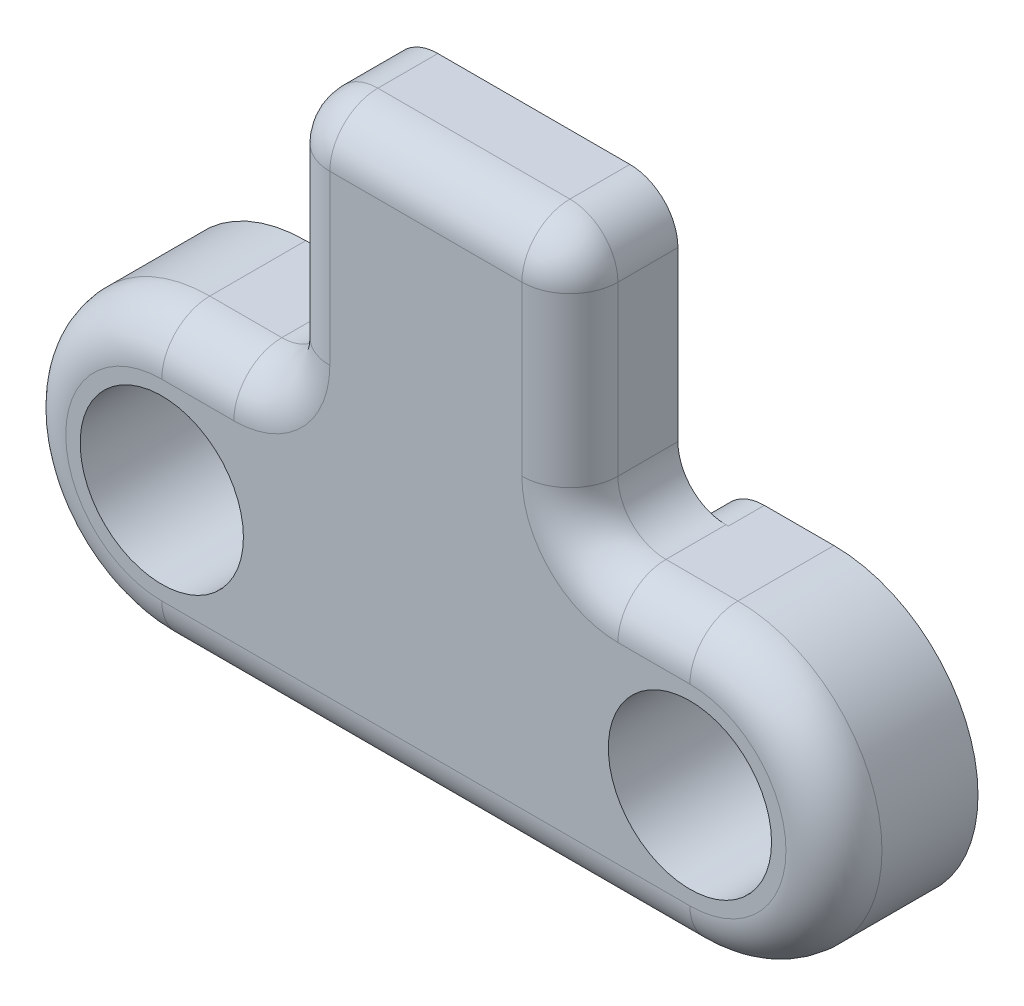
ISO-10303-21;
HEADER;
FILE_DESCRIPTION(('STEP AP214'),'2;1');
FILE_NAME('part.step','',(''),(''),'','','');
FILE_SCHEMA(('AUTOMOTIVE_DESIGN { 1 0 10303 214 1 1 1 1 }'));
ENDSEC;
DATA;
#1=APPLICATION_CONTEXT('core data for automotive mechanical design processes');
#2=APPLICATION_PROTOCOL_DEFINITION('international standard','automotive_design',2000,#1);
#3=PRODUCT_CONTEXT('',#1,'mechanical');
#4=PRODUCT('Part','Part','',(#3));
#5=PRODUCT_RELATED_PRODUCT_CATEGORY('part','',(#4));
#6=PRODUCT_DEFINITION_FORMATION('','',#4);
#7=PRODUCT_DEFINITION_CONTEXT('part definition',#1,'design');
#8=PRODUCT_DEFINITION('design','',#6,#7);
#9=PRODUCT_DEFINITION_SHAPE('','',#8);
#10=(LENGTH_UNIT() NAMED_UNIT(*) SI_UNIT(.MILLI.,.METRE.));
#11=(NAMED_UNIT(*) PLANE_ANGLE_UNIT() SI_UNIT($,.RADIAN.));
#12=(NAMED_UNIT(*) SI_UNIT($,.STERADIAN.) SOLID_ANGLE_UNIT());
#13=UNCERTAINTY_MEASURE_WITH_UNIT(LENGTH_MEASURE(1.E-05),#10,'distance_accuracy_value','');
#14=(GEOMETRIC_REPRESENTATION_CONTEXT(3) GLOBAL_UNCERTAINTY_ASSIGNED_CONTEXT((#13)) GLOBAL_UNIT_ASSIGNED_CONTEXT((#10,
#11,#12)) REPRESENTATION_CONTEXT('',''));
#15=CARTESIAN_POINT('',(0.,0.,0.));
#16=DIRECTION('',(0.,0.,1.));
#17=DIRECTION('',(1.,0.,0.));
#18=AXIS2_PLACEMENT_3D('',#15,#16,#17);
#19=CARTESIAN_POINT('',(0.,0.,0.));
#20=DIRECTION('',(0.,0.,1.));
#21=DIRECTION('',(1.,0.,0.));
#22=AXIS2_PLACEMENT_3D('',#19,#20,#21);
#23=PLANE('',#22);
#24=CARTESIAN_POINT('',(-5.5,0.,0.));
#25=DIRECTION('',(0.,0.,1.));
#26=DIRECTION('',(1.,0.,0.));
#27=AXIS2_PLACEMENT_3D('',#24,#25,#26);
#28=CIRCLE('',#27,1.7);
#29=CARTESIAN_POINT('',(-3.8,0.,0.));
#30=VERTEX_POINT('',#29);
#31=EDGE_CURVE('E314',#30,#30,#28,.T.);
#32=ORIENTED_EDGE('',*,*,#31,.T.);
#33=EDGE_LOOP('',(#32));
#34=FACE_BOUND('',#33,.T.);
#35=DIRECTION('',(0.,1.,0.));
#36=VECTOR('',#35,1.);
#37=CARTESIAN_POINT('',(-3.05,-3.,0.));
#38=LINE('',#37,#36);
#39=CARTESIAN_POINT('',(-3.05,-2.,0.));
#40=VERTEX_POINT('',#39);
#41=CARTESIAN_POINT('',(-3.05,2.,0.));
#42=VERTEX_POINT('',#41);
#43=EDGE_CURVE('E570',#40,#42,#38,.T.);
#44=ORIENTED_EDGE('',*,*,#43,.F.);
#45=CARTESIAN_POINT('',(-4.05,-2.,0.));
#46=DIRECTION('',(0.,0.,1.));
#47=DIRECTION('',(1.,0.,0.));
#48=AXIS2_PLACEMENT_3D('',#45,#46,#47);
#49=CIRCLE('',#48,1.);
#50=CARTESIAN_POINT('',(-4.05,-3.,0.));
#51=VERTEX_POINT('',#50);
#52=EDGE_CURVE('E490',#40,#51,#49,.F.);
#53=ORIENTED_EDGE('',*,*,#52,.T.);
#54=DIRECTION('',(1.,0.,0.));
#55=VECTOR('',#54,1.);
#56=CARTESIAN_POINT('',(0.,-3.,0.));
#57=LINE('',#56,#55);
#58=CARTESIAN_POINT('',(-5.5,-3.,0.));
#59=VERTEX_POINT('',#58);
#60=EDGE_CURVE('E313',#59,#51,#57,.T.);
#61=ORIENTED_EDGE('',*,*,#60,.F.);
#62=CARTESIAN_POINT('',(-5.5,0.,0.));
#63=DIRECTION('',(0.,0.,1.));
#64=DIRECTION('',(1.,0.,0.));
#65=AXIS2_PLACEMENT_3D('',#62,#63,#64);
#66=CIRCLE('',#65,3.);
#67=CARTESIAN_POINT('',(-5.5,3.,0.));
#68=VERTEX_POINT('',#67);
#69=EDGE_CURVE('E333',#68,#59,#66,.T.);
#70=ORIENTED_EDGE('',*,*,#69,.F.);
#71=DIRECTION('',(1.,0.,0.));
#72=VECTOR('',#71,1.);
#73=CARTESIAN_POINT('',(0.,3.,0.));
#74=LINE('',#73,#72);
#75=CARTESIAN_POINT('',(-4.05,3.,0.));
#76=VERTEX_POINT('',#75);
#77=EDGE_CURVE('E325',#68,#76,#74,.T.);
#78=ORIENTED_EDGE('',*,*,#77,.T.);
#79=CARTESIAN_POINT('',(-4.05,2.,0.));
#80=DIRECTION('',(0.,0.,1.));
#81=DIRECTION('',(1.,0.,0.));
#82=AXIS2_PLACEMENT_3D('',#79,#80,#81);
#83=CIRCLE('',#82,1.);
#84=EDGE_CURVE('E487',#76,#42,#83,.F.);
#85=ORIENTED_EDGE('',*,*,#84,.T.);
#86=EDGE_LOOP('',(#44,#53,#61,#70,#78,#85));
#87=FACE_BOUND('',#86,.T.);
#88=ADVANCED_FACE('F72',(#34,#87),#23,.F.);
#89=CARTESIAN_POINT('',(5.5,0.,3.));
#90=DIRECTION('',(0.,0.,-1.));
#91=DIRECTION('',(-1.,0.,0.));
#92=AXIS2_PLACEMENT_3D('',#89,#90,#91);
#93=CYLINDRICAL_SURFACE('',#92,3.);
#94=DIRECTION('',(0.,0.,-1.));
#95=VECTOR('',#94,1.);
#96=CARTESIAN_POINT('',(5.5,3.,3.));
#97=LINE('',#96,#95);
#98=CARTESIAN_POINT('',(5.5,3.,2.));
#99=VERTEX_POINT('',#98);
#100=CARTESIAN_POINT('',(5.5,3.,0.));
#101=VERTEX_POINT('',#100);
#102=EDGE_CURVE('E303',#99,#101,#97,.T.);
#103=ORIENTED_EDGE('',*,*,#102,.F.);
#104=CARTESIAN_POINT('',(5.5,0.,2.));
#105=DIRECTION('',(0.,0.,1.));
#106=DIRECTION('',(1.,0.,0.));
#107=AXIS2_PLACEMENT_3D('',#104,#105,#106);
#108=CIRCLE('',#107,3.);
#109=CARTESIAN_POINT('',(5.5,-3.,2.));
#110=VERTEX_POINT('',#109);
#111=EDGE_CURVE('E298',#99,#110,#108,.F.);
#112=ORIENTED_EDGE('',*,*,#111,.T.);
#113=DIRECTION('',(0.,0.,-1.));
#114=VECTOR('',#113,1.);
#115=CARTESIAN_POINT('',(5.5,-3.,3.));
#116=LINE('',#115,#114);
#117=CARTESIAN_POINT('',(5.5,-3.,0.));
#118=VERTEX_POINT('',#117);
#119=EDGE_CURVE('E291',#110,#118,#116,.T.);
#120=ORIENTED_EDGE('',*,*,#119,.T.);
#121=CARTESIAN_POINT('',(5.5,0.,0.));
#122=DIRECTION('',(0.,0.,1.));
#123=DIRECTION('',(1.,0.,0.));
#124=AXIS2_PLACEMENT_3D('',#121,#122,#123);
#125=CIRCLE('',#124,3.);
#126=EDGE_CURVE('E296',#118,#101,#125,.T.);
#127=ORIENTED_EDGE('',*,*,#126,.T.);
#128=EDGE_LOOP('',(#103,#112,#120,#127));
#129=FACE_BOUND('',#128,.T.);
#130=ADVANCED_FACE('F294',(#129),#93,.T.);
#131=CARTESIAN_POINT('',(0.,3.,3.));
#132=DIRECTION('',(0.,1.,0.));
#133=DIRECTION('',(0.,0.,1.));
#134=AXIS2_PLACEMENT_3D('',#131,#132,#133);
#135=PLANE('',#134);
#136=DIRECTION('',(0.,0.,1.));
#137=VECTOR('',#136,1.);
#138=CARTESIAN_POINT('',(4.,3.,3.));
#139=LINE('',#138,#137);
#140=CARTESIAN_POINT('',(4.,3.,0.750000000000001));
#141=VERTEX_POINT('',#140);
#142=CARTESIAN_POINT('',(4.,3.,2.));
#143=VERTEX_POINT('',#142);
#144=EDGE_CURVE('E377',#141,#143,#139,.T.);
#145=ORIENTED_EDGE('',*,*,#144,.T.);
#146=DIRECTION('',(1.,0.,0.));
#147=VECTOR('',#146,1.);
#148=CARTESIAN_POINT('',(0.,3.,2.));
#149=LINE('',#148,#147);
#150=EDGE_CURVE('E444',#143,#99,#149,.T.);
#151=ORIENTED_EDGE('',*,*,#150,.T.);
#152=ORIENTED_EDGE('',*,*,#102,.T.);
#153=CARTESIAN_POINT('',(4.05,3.,0.));
#154=VERTEX_POINT('',#153);
#155=EDGE_CURVE('E318',#154,#101,#74,.T.);
#156=ORIENTED_EDGE('',*,*,#155,.F.);
#157=DIRECTION('',(0.,0.,-1.));
#158=VECTOR('',#157,1.);
#159=CARTESIAN_POINT('',(4.05,3.,0.750000000000001));
#160=LINE('',#159,#158);
#161=CARTESIAN_POINT('',(4.05,3.,0.750000000000001));
#162=VERTEX_POINT('',#161);
#163=EDGE_CURVE('E440',#154,#162,#160,.F.);
#164=ORIENTED_EDGE('',*,*,#163,.T.);
#165=DIRECTION('',(-1.,0.,0.));
#166=VECTOR('',#165,1.);
#167=CARTESIAN_POINT('',(-3.05,3.,0.750000000000001));
#168=LINE('',#167,#166);
#169=EDGE_CURVE('E436',#162,#141,#168,.T.);
#170=ORIENTED_EDGE('',*,*,#169,.T.);
#171=EDGE_LOOP('',(#145,#151,#152,#156,#164,#170));
#172=FACE_BOUND('',#171,.T.);
#173=ADVANCED_FACE('F620',(#172),#135,.T.);
#174=DIRECTION('',(0.,0.,-1.));
#175=VECTOR('',#174,1.);
#176=CARTESIAN_POINT('',(-5.5,3.,3.));
#177=LINE('',#176,#175);
#178=CARTESIAN_POINT('',(-5.5,3.,2.));
#179=VERTEX_POINT('',#178);
#180=EDGE_CURVE('E341',#179,#68,#177,.T.);
#181=ORIENTED_EDGE('',*,*,#180,.F.);
#182=DIRECTION('',(1.,0.,0.));
#183=VECTOR('',#182,1.);
#184=CARTESIAN_POINT('',(0.,3.,2.));
#185=LINE('',#184,#183);
#186=CARTESIAN_POINT('',(-4.,3.,2.));
#187=VERTEX_POINT('',#186);
#188=EDGE_CURVE('E499',#179,#187,#185,.T.);
#189=ORIENTED_EDGE('',*,*,#188,.T.);
#190=DIRECTION('',(0.,0.,1.));
#191=VECTOR('',#190,1.);
#192=CARTESIAN_POINT('',(-4.,3.,0.750000000000001));
#193=LINE('',#192,#191);
#194=CARTESIAN_POINT('',(-4.,3.,0.750000000000001));
#195=VERTEX_POINT('',#194);
#196=EDGE_CURVE('E381',#187,#195,#193,.F.);
#197=ORIENTED_EDGE('',*,*,#196,.T.);
#198=DIRECTION('',(-1.,0.,0.));
#199=VECTOR('',#198,1.);
#200=CARTESIAN_POINT('',(-3.05,3.,0.750000000000001));
#201=LINE('',#200,#199);
#202=CARTESIAN_POINT('',(-4.05,3.,0.750000000000001));
#203=VERTEX_POINT('',#202);
#204=EDGE_CURVE('E496',#195,#203,#201,.T.);
#205=ORIENTED_EDGE('',*,*,#204,.T.);
#206=DIRECTION('',(0.,0.,1.));
#207=VECTOR('',#206,1.);
#208=CARTESIAN_POINT('',(-4.05,3.,0.));
#209=LINE('',#208,#207);
#210=EDGE_CURVE('E493',#203,#76,#209,.F.);
#211=ORIENTED_EDGE('',*,*,#210,.T.);
#212=ORIENTED_EDGE('',*,*,#77,.F.);
#213=EDGE_LOOP('',(#181,#189,#197,#205,#211,#212));
#214=FACE_BOUND('',#213,.T.);
#215=ADVANCED_FACE('F750',(#214),#135,.T.);
#216=CARTESIAN_POINT('',(-5.5,0.,3.));
#217=DIRECTION('',(0.,0.,-1.));
#218=DIRECTION('',(-1.,0.,0.));
#219=AXIS2_PLACEMENT_3D('',#216,#217,#218);
#220=CYLINDRICAL_SURFACE('',#219,3.);
#221=DIRECTION('',(0.,0.,-1.));
#222=VECTOR('',#221,1.);
#223=CARTESIAN_POINT('',(-5.5,-3.,3.));
#224=LINE('',#223,#222);
#225=CARTESIAN_POINT('',(-5.5,-3.,2.));
#226=VERTEX_POINT('',#225);
#227=EDGE_CURVE('E338',#226,#59,#224,.T.);
#228=ORIENTED_EDGE('',*,*,#227,.F.);
#229=CARTESIAN_POINT('',(-5.5,0.,2.));
#230=DIRECTION('',(0.,0.,1.));
#231=DIRECTION('',(1.,0.,0.));
#232=AXIS2_PLACEMENT_3D('',#229,#230,#231);
#233=CIRCLE('',#232,3.);
#234=EDGE_CURVE('E421',#226,#179,#233,.F.);
#235=ORIENTED_EDGE('',*,*,#234,.T.);
#236=ORIENTED_EDGE('',*,*,#180,.T.);
#237=ORIENTED_EDGE('',*,*,#69,.T.);
#238=EDGE_LOOP('',(#228,#235,#236,#237));
#239=FACE_BOUND('',#238,.T.);
#240=ADVANCED_FACE('F613',(#239),#220,.T.);
#241=CARTESIAN_POINT('',(0.,-3.,3.));
#242=DIRECTION('',(0.,1.,0.));
#243=DIRECTION('',(0.,0.,1.));
#244=AXIS2_PLACEMENT_3D('',#241,#242,#243);
#245=PLANE('',#244);
#246=ORIENTED_EDGE('',*,*,#119,.F.);
#247=DIRECTION('',(1.,0.,0.));
#248=VECTOR('',#247,1.);
#249=CARTESIAN_POINT('',(-5.5,-3.,2.));
#250=LINE('',#249,#248);
#251=EDGE_CURVE('E431',#110,#226,#250,.F.);
#252=ORIENTED_EDGE('',*,*,#251,.T.);
#253=ORIENTED_EDGE('',*,*,#227,.T.);
#254=ORIENTED_EDGE('',*,*,#60,.T.);
#255=DIRECTION('',(0.,0.,1.));
#256=VECTOR('',#255,1.);
#257=CARTESIAN_POINT('',(-4.05,-3.,3.));
#258=LINE('',#257,#256);
#259=CARTESIAN_POINT('',(-4.05,-3.,0.750000000000001));
#260=VERTEX_POINT('',#259);
#261=EDGE_CURVE('E425',#51,#260,#258,.T.);
#262=ORIENTED_EDGE('',*,*,#261,.T.);
#263=DIRECTION('',(1.,0.,0.));
#264=VECTOR('',#263,1.);
#265=CARTESIAN_POINT('',(-3.05,-3.,0.750000000000001));
#266=LINE('',#265,#264);
#267=CARTESIAN_POINT('',(4.05,-3.,0.750000000000001));
#268=VERTEX_POINT('',#267);
#269=EDGE_CURVE('E558',#260,#268,#266,.T.);
#270=ORIENTED_EDGE('',*,*,#269,.T.);
#271=DIRECTION('',(0.,0.,-1.));
#272=VECTOR('',#271,1.);
#273=CARTESIAN_POINT('',(4.05,-3.,3.));
#274=LINE('',#273,#272);
#275=CARTESIAN_POINT('',(4.05,-3.,0.));
#276=VERTEX_POINT('',#275);
#277=EDGE_CURVE('E310',#268,#276,#274,.T.);
#278=ORIENTED_EDGE('',*,*,#277,.T.);
#279=EDGE_CURVE('E307',#276,#118,#57,.T.);
#280=ORIENTED_EDGE('',*,*,#279,.T.);
#281=EDGE_LOOP('',(#246,#252,#253,#254,#262,#270,#278,#280));
#282=FACE_BOUND('',#281,.T.);
#283=ADVANCED_FACE('F308',(#282),#245,.F.);
#284=CARTESIAN_POINT('',(-5.5,0.,3.));
#285=DIRECTION('',(0.,0.,-1.));
#286=DIRECTION('',(-1.,0.,0.));
#287=AXIS2_PLACEMENT_3D('',#284,#285,#286);
#288=CYLINDRICAL_SURFACE('',#287,1.7);
#289=CARTESIAN_POINT('',(-5.5,0.,3.));
#290=DIRECTION('',(0.,0.,1.));
#291=DIRECTION('',(1.,0.,0.));
#292=AXIS2_PLACEMENT_3D('',#289,#290,#291);
#293=CIRCLE('',#292,1.7);
#294=CARTESIAN_POINT('',(-3.8,0.,3.));
#295=VERTEX_POINT('',#294);
#296=EDGE_CURVE('E342',#295,#295,#293,.T.);
#297=ORIENTED_EDGE('',*,*,#296,.T.);
#298=EDGE_LOOP('',(#297));
#299=FACE_BOUND('',#298,.T.);
#300=ORIENTED_EDGE('',*,*,#31,.F.);
#301=EDGE_LOOP('',(#300));
#302=FACE_BOUND('',#301,.T.);
#303=ADVANCED_FACE('F602',(#299,#302),#288,.F.);
#304=CARTESIAN_POINT('',(5.5,0.,3.));
#305=DIRECTION('',(0.,0.,-1.));
#306=DIRECTION('',(-1.,0.,0.));
#307=AXIS2_PLACEMENT_3D('',#304,#305,#306);
#308=CYLINDRICAL_SURFACE('',#307,1.7);
#309=CARTESIAN_POINT('',(5.5,0.,3.));
#310=DIRECTION('',(0.,0.,1.));
#311=DIRECTION('',(1.,0.,0.));
#312=AXIS2_PLACEMENT_3D('',#309,#310,#311);
#313=CIRCLE('',#312,1.7);
#314=CARTESIAN_POINT('',(7.2,0.,3.));
#315=VERTEX_POINT('',#314);
#316=EDGE_CURVE('E337',#315,#315,#313,.T.);
#317=ORIENTED_EDGE('',*,*,#316,.T.);
#318=EDGE_LOOP('',(#317));
#319=FACE_BOUND('',#318,.T.);
#320=CARTESIAN_POINT('',(5.5,0.,0.));
#321=DIRECTION('',(0.,0.,1.));
#322=DIRECTION('',(1.,0.,0.));
#323=AXIS2_PLACEMENT_3D('',#320,#321,#322);
#324=CIRCLE('',#323,1.7);
#325=CARTESIAN_POINT('',(7.2,0.,0.));
#326=VERTEX_POINT('',#325);
#327=EDGE_CURVE('E588',#326,#326,#324,.T.);
#328=ORIENTED_EDGE('',*,*,#327,.F.);
#329=EDGE_LOOP('',(#328));
#330=FACE_BOUND('',#329,.T.);
#331=ADVANCED_FACE('F604',(#319,#330),#308,.F.);
#332=ORIENTED_EDGE('',*,*,#327,.T.);
#333=EDGE_LOOP('',(#332));
#334=FACE_BOUND('',#333,.T.);
#335=ORIENTED_EDGE('',*,*,#279,.F.);
#336=CARTESIAN_POINT('',(4.05,-2.,0.));
#337=DIRECTION('',(0.,0.,1.));
#338=DIRECTION('',(1.,0.,0.));
#339=AXIS2_PLACEMENT_3D('',#336,#337,#338);
#340=CIRCLE('',#339,1.);
#341=CARTESIAN_POINT('',(3.05,-2.,0.));
#342=VERTEX_POINT('',#341);
#343=EDGE_CURVE('E470',#276,#342,#340,.F.);
#344=ORIENTED_EDGE('',*,*,#343,.T.);
#345=DIRECTION('',(0.,1.,0.));
#346=VECTOR('',#345,1.);
#347=CARTESIAN_POINT('',(3.05,-3.,0.));
#348=LINE('',#347,#346);
#349=CARTESIAN_POINT('',(3.05,2.,0.));
#350=VERTEX_POINT('',#349);
#351=EDGE_CURVE('E575',#342,#350,#348,.T.);
#352=ORIENTED_EDGE('',*,*,#351,.T.);
#353=CARTESIAN_POINT('',(4.05,2.,0.));
#354=DIRECTION('',(0.,0.,1.));
#355=DIRECTION('',(1.,0.,0.));
#356=AXIS2_PLACEMENT_3D('',#353,#354,#355);
#357=CIRCLE('',#356,1.);
#358=EDGE_CURVE('E467',#350,#154,#357,.F.);
#359=ORIENTED_EDGE('',*,*,#358,.T.);
#360=ORIENTED_EDGE('',*,*,#155,.T.);
#361=ORIENTED_EDGE('',*,*,#126,.F.);
#362=EDGE_LOOP('',(#335,#344,#352,#359,#360,#361));
#363=FACE_BOUND('',#362,.T.);
#364=ADVANCED_FACE('F316',(#334,#363),#23,.F.);
#365=CARTESIAN_POINT('',(0.,0.,3.));
#366=DIRECTION('',(0.,0.,1.));
#367=DIRECTION('',(1.,0.,0.));
#368=AXIS2_PLACEMENT_3D('',#365,#366,#367);
#369=PLANE('',#368);
#370=DIRECTION('',(1.,0.,0.));
#371=VECTOR('',#370,1.);
#372=CARTESIAN_POINT('',(0.,2.,3.));
#373=LINE('',#372,#371);
#374=CARTESIAN_POINT('',(-4.,2.,3.));
#375=VERTEX_POINT('',#374);
#376=CARTESIAN_POINT('',(-5.5,2.,3.));
#377=VERTEX_POINT('',#376);
#378=EDGE_CURVE('E390',#375,#377,#373,.F.);
#379=ORIENTED_EDGE('',*,*,#378,.T.);
#380=CARTESIAN_POINT('',(-5.5,0.,3.));
#381=DIRECTION('',(0.,0.,1.));
#382=DIRECTION('',(1.,0.,0.));
#383=AXIS2_PLACEMENT_3D('',#380,#381,#382);
#384=CIRCLE('',#383,2.);
#385=CARTESIAN_POINT('',(-5.5,-2.,3.));
#386=VERTEX_POINT('',#385);
#387=EDGE_CURVE('E417',#377,#386,#384,.T.);
#388=ORIENTED_EDGE('',*,*,#387,.T.);
#389=DIRECTION('',(1.,0.,0.));
#390=VECTOR('',#389,1.);
#391=CARTESIAN_POINT('',(5.5,-2.,3.));
#392=LINE('',#391,#390);
#393=CARTESIAN_POINT('',(5.5,-2.,3.));
#394=VERTEX_POINT('',#393);
#395=EDGE_CURVE('E414',#386,#394,#392,.T.);
#396=ORIENTED_EDGE('',*,*,#395,.T.);
#397=CARTESIAN_POINT('',(5.5,0.,3.));
#398=DIRECTION('',(0.,0.,1.));
#399=DIRECTION('',(1.,0.,0.));
#400=AXIS2_PLACEMENT_3D('',#397,#398,#399);
#401=CIRCLE('',#400,2.);
#402=CARTESIAN_POINT('',(5.5,2.,3.));
#403=VERTEX_POINT('',#402);
#404=EDGE_CURVE('E411',#394,#403,#401,.T.);
#405=ORIENTED_EDGE('',*,*,#404,.T.);
#406=DIRECTION('',(1.,0.,0.));
#407=VECTOR('',#406,1.);
#408=CARTESIAN_POINT('',(0.,2.,3.));
#409=LINE('',#408,#407);
#410=CARTESIAN_POINT('',(4.,2.,3.));
#411=VERTEX_POINT('',#410);
#412=EDGE_CURVE('E408',#403,#411,#409,.F.);
#413=ORIENTED_EDGE('',*,*,#412,.T.);
#414=CARTESIAN_POINT('',(4.,4.,3.));
#415=DIRECTION('',(0.,0.,1.));
#416=DIRECTION('',(1.,0.,0.));
#417=AXIS2_PLACEMENT_3D('',#414,#415,#416);
#418=CIRCLE('',#417,2.);
#419=CARTESIAN_POINT('',(2.,4.,3.));
#420=VERTEX_POINT('',#419);
#421=EDGE_CURVE('E405',#411,#420,#418,.F.);
#422=ORIENTED_EDGE('',*,*,#421,.T.);
#423=DIRECTION('',(0.,1.,0.));
#424=VECTOR('',#423,1.);
#425=CARTESIAN_POINT('',(2.,7.5,3.));
#426=LINE('',#425,#424);
#427=CARTESIAN_POINT('',(2.,7.5,3.));
#428=VERTEX_POINT('',#427);
#429=EDGE_CURVE('E402',#420,#428,#426,.T.);
#430=ORIENTED_EDGE('',*,*,#429,.T.);
#431=DIRECTION('',(1.,0.,0.));
#432=VECTOR('',#431,1.);
#433=CARTESIAN_POINT('',(0.,7.5,3.));
#434=LINE('',#433,#432);
#435=CARTESIAN_POINT('',(-2.,7.5,3.));
#436=VERTEX_POINT('',#435);
#437=EDGE_CURVE('E399',#428,#436,#434,.F.);
#438=ORIENTED_EDGE('',*,*,#437,.T.);
#439=DIRECTION('',(0.,1.,0.));
#440=VECTOR('',#439,1.);
#441=CARTESIAN_POINT('',(-2.,0.,3.));
#442=LINE('',#441,#440);
#443=CARTESIAN_POINT('',(-2.,4.,3.));
#444=VERTEX_POINT('',#443);
#445=EDGE_CURVE('E396',#436,#444,#442,.F.);
#446=ORIENTED_EDGE('',*,*,#445,.T.);
#447=CARTESIAN_POINT('',(-4.,4.,3.));
#448=DIRECTION('',(0.,0.,1.));
#449=DIRECTION('',(1.,0.,0.));
#450=AXIS2_PLACEMENT_3D('',#447,#448,#449);
#451=CIRCLE('',#450,2.);
#452=EDGE_CURVE('E393',#444,#375,#451,.F.);
#453=ORIENTED_EDGE('',*,*,#452,.T.);
#454=EDGE_LOOP('',(#379,#388,#396,#405,#413,#422,#430,#438,#446,#453));
#455=FACE_BOUND('',#454,.T.);
#456=ORIENTED_EDGE('',*,*,#316,.F.);
#457=EDGE_LOOP('',(#456));
#458=FACE_BOUND('',#457,.T.);
#459=ORIENTED_EDGE('',*,*,#296,.F.);
#460=EDGE_LOOP('',(#459));
#461=FACE_BOUND('',#460,.T.);
#462=ADVANCED_FACE('F625',(#455,#458,#461),#369,.T.);
#463=CARTESIAN_POINT('',(-3.,3.,3.));
#464=DIRECTION('',(-1.,0.,0.));
#465=DIRECTION('',(0.,0.,1.));
#466=AXIS2_PLACEMENT_3D('',#463,#464,#465);
#467=PLANE('',#466);
#468=DIRECTION('',(0.,0.,1.));
#469=VECTOR('',#468,1.);
#470=CARTESIAN_POINT('',(-3.,4.,3.));
#471=LINE('',#470,#469);
#472=CARTESIAN_POINT('',(-3.,4.,0.750000000000001));
#473=VERTEX_POINT('',#472);
#474=CARTESIAN_POINT('',(-3.,4.,2.));
#475=VERTEX_POINT('',#474);
#476=EDGE_CURVE('E370',#473,#475,#471,.T.);
#477=ORIENTED_EDGE('',*,*,#476,.T.);
#478=DIRECTION('',(0.,1.,0.));
#479=VECTOR('',#478,1.);
#480=CARTESIAN_POINT('',(-3.,3.,2.));
#481=LINE('',#480,#479);
#482=CARTESIAN_POINT('',(-3.,7.5,2.));
#483=VERTEX_POINT('',#482);
#484=EDGE_CURVE('E461',#475,#483,#481,.T.);
#485=ORIENTED_EDGE('',*,*,#484,.T.);
#486=DIRECTION('',(0.,0.,-1.));
#487=VECTOR('',#486,1.);
#488=CARTESIAN_POINT('',(-3.,7.5,3.));
#489=LINE('',#488,#487);
#490=CARTESIAN_POINT('',(-3.,7.5,0.750000000000001));
#491=VERTEX_POINT('',#490);
#492=EDGE_CURVE('E374',#483,#491,#489,.T.);
#493=ORIENTED_EDGE('',*,*,#492,.T.);
#494=DIRECTION('',(0.,1.,0.));
#495=VECTOR('',#494,1.);
#496=CARTESIAN_POINT('',(-3.,3.,0.750000000000001));
#497=LINE('',#496,#495);
#498=EDGE_CURVE('E584',#473,#491,#497,.T.);
#499=ORIENTED_EDGE('',*,*,#498,.F.);
#500=EDGE_LOOP('',(#477,#485,#493,#499));
#501=FACE_BOUND('',#500,.T.);
#502=ADVANCED_FACE('F630',(#501),#467,.T.);
#503=CARTESIAN_POINT('',(3.,3.,3.));
#504=DIRECTION('',(-1.,0.,0.));
#505=DIRECTION('',(0.,0.,1.));
#506=AXIS2_PLACEMENT_3D('',#503,#504,#505);
#507=PLANE('',#506);
#508=DIRECTION('',(0.,0.,-1.));
#509=VECTOR('',#508,1.);
#510=CARTESIAN_POINT('',(3.,7.5,3.));
#511=LINE('',#510,#509);
#512=CARTESIAN_POINT('',(3.,7.5,0.750000000000001));
#513=VERTEX_POINT('',#512);
#514=CARTESIAN_POINT('',(3.,7.5,2.));
#515=VERTEX_POINT('',#514);
#516=EDGE_CURVE('E366',#513,#515,#511,.F.);
#517=ORIENTED_EDGE('',*,*,#516,.T.);
#518=DIRECTION('',(0.,1.,0.));
#519=VECTOR('',#518,1.);
#520=CARTESIAN_POINT('',(3.,4.,2.));
#521=LINE('',#520,#519);
#522=CARTESIAN_POINT('',(3.,4.,2.));
#523=VERTEX_POINT('',#522);
#524=EDGE_CURVE('E450',#515,#523,#521,.F.);
#525=ORIENTED_EDGE('',*,*,#524,.T.);
#526=DIRECTION('',(0.,0.,1.));
#527=VECTOR('',#526,1.);
#528=CARTESIAN_POINT('',(3.,4.,3.));
#529=LINE('',#528,#527);
#530=CARTESIAN_POINT('',(3.,4.,0.750000000000001));
#531=VERTEX_POINT('',#530);
#532=EDGE_CURVE('E363',#523,#531,#529,.F.);
#533=ORIENTED_EDGE('',*,*,#532,.T.);
#534=DIRECTION('',(0.,1.,0.));
#535=VECTOR('',#534,1.);
#536=CARTESIAN_POINT('',(3.,3.,0.750000000000001));
#537=LINE('',#536,#535);
#538=EDGE_CURVE('E574',#531,#513,#537,.T.);
#539=ORIENTED_EDGE('',*,*,#538,.T.);
#540=EDGE_LOOP('',(#517,#525,#533,#539));
#541=FACE_BOUND('',#540,.T.);
#542=ADVANCED_FACE('F638',(#541),#507,.F.);
#543=CARTESIAN_POINT('',(-3.,8.5,3.));
#544=DIRECTION('',(0.,1.,0.));
#545=DIRECTION('',(0.,0.,1.));
#546=AXIS2_PLACEMENT_3D('',#543,#544,#545);
#547=PLANE('',#546);
#548=DIRECTION('',(0.,0.,-1.));
#549=VECTOR('',#548,1.);
#550=CARTESIAN_POINT('',(-2.,8.5,3.));
#551=LINE('',#550,#549);
#552=CARTESIAN_POINT('',(-2.,8.5,0.750000000000001));
#553=VERTEX_POINT('',#552);
#554=CARTESIAN_POINT('',(-2.,8.5,2.));
#555=VERTEX_POINT('',#554);
#556=EDGE_CURVE('E350',#553,#555,#551,.F.);
#557=ORIENTED_EDGE('',*,*,#556,.T.);
#558=DIRECTION('',(1.,0.,0.));
#559=VECTOR('',#558,1.);
#560=CARTESIAN_POINT('',(-3.,8.5,2.));
#561=LINE('',#560,#559);
#562=CARTESIAN_POINT('',(2.,8.5,2.));
#563=VERTEX_POINT('',#562);
#564=EDGE_CURVE('E455',#555,#563,#561,.T.);
#565=ORIENTED_EDGE('',*,*,#564,.T.);
#566=DIRECTION('',(0.,0.,-1.));
#567=VECTOR('',#566,1.);
#568=CARTESIAN_POINT('',(2.,8.5,0.750000000000001));
#569=LINE('',#568,#567);
#570=CARTESIAN_POINT('',(2.,8.5,0.750000000000001));
#571=VERTEX_POINT('',#570);
#572=EDGE_CURVE('E354',#563,#571,#569,.T.);
#573=ORIENTED_EDGE('',*,*,#572,.T.);
#574=DIRECTION('',(1.,0.,0.));
#575=VECTOR('',#574,1.);
#576=CARTESIAN_POINT('',(-3.,8.5,0.750000000000001));
#577=LINE('',#576,#575);
#578=EDGE_CURVE('E302',#553,#571,#577,.T.);
#579=ORIENTED_EDGE('',*,*,#578,.F.);
#580=EDGE_LOOP('',(#557,#565,#573,#579));
#581=FACE_BOUND('',#580,.T.);
#582=ADVANCED_FACE('F632',(#581),#547,.T.);
#583=CARTESIAN_POINT('',(-3.05,-3.,0.));
#584=DIRECTION('',(-1.,0.,0.));
#585=DIRECTION('',(0.,0.,1.));
#586=AXIS2_PLACEMENT_3D('',#583,#584,#585);
#587=PLANE('',#586);
#588=DIRECTION('',(0.,1.,0.));
#589=VECTOR('',#588,1.);
#590=CARTESIAN_POINT('',(-3.05,-3.,0.750000000000001));
#591=LINE('',#590,#589);
#592=CARTESIAN_POINT('',(-3.05,-2.,0.750000000000001));
#593=VERTEX_POINT('',#592);
#594=CARTESIAN_POINT('',(-3.05,2.,0.750000000000001));
#595=VERTEX_POINT('',#594);
#596=EDGE_CURVE('E564',#593,#595,#591,.T.);
#597=ORIENTED_EDGE('',*,*,#596,.F.);
#598=DIRECTION('',(0.,0.,1.));
#599=VECTOR('',#598,1.);
#600=CARTESIAN_POINT('',(-3.05,-2.,0.));
#601=LINE('',#600,#599);
#602=EDGE_CURVE('E484',#593,#40,#601,.F.);
#603=ORIENTED_EDGE('',*,*,#602,.T.);
#604=ORIENTED_EDGE('',*,*,#43,.T.);
#605=DIRECTION('',(0.,0.,1.));
#606=VECTOR('',#605,1.);
#607=CARTESIAN_POINT('',(-3.05,2.,0.750000000000001));
#608=LINE('',#607,#606);
#609=EDGE_CURVE('E480',#42,#595,#608,.T.);
#610=ORIENTED_EDGE('',*,*,#609,.T.);
#611=EDGE_LOOP('',(#597,#603,#604,#610));
#612=FACE_BOUND('',#611,.T.);
#613=ADVANCED_FACE('F644',(#612),#587,.F.);
#614=CARTESIAN_POINT('',(3.05,-3.,0.));
#615=DIRECTION('',(1.,0.,0.));
#616=DIRECTION('',(0.,0.,-1.));
#617=AXIS2_PLACEMENT_3D('',#614,#615,#616);
#618=PLANE('',#617);
#619=ORIENTED_EDGE('',*,*,#351,.F.);
#620=DIRECTION('',(0.,0.,-1.));
#621=VECTOR('',#620,1.);
#622=CARTESIAN_POINT('',(3.05,-2.,0.));
#623=LINE('',#622,#621);
#624=CARTESIAN_POINT('',(3.05,-2.,0.750000000000001));
#625=VERTEX_POINT('',#624);
#626=EDGE_CURVE('E477',#342,#625,#623,.F.);
#627=ORIENTED_EDGE('',*,*,#626,.T.);
#628=DIRECTION('',(0.,1.,0.));
#629=VECTOR('',#628,1.);
#630=CARTESIAN_POINT('',(3.05,-3.,0.750000000000001));
#631=LINE('',#630,#629);
#632=CARTESIAN_POINT('',(3.05,2.,0.750000000000001));
#633=VERTEX_POINT('',#632);
#634=EDGE_CURVE('E567',#625,#633,#631,.T.);
#635=ORIENTED_EDGE('',*,*,#634,.T.);
#636=DIRECTION('',(0.,0.,-1.));
#637=VECTOR('',#636,1.);
#638=CARTESIAN_POINT('',(3.05,2.,0.));
#639=LINE('',#638,#637);
#640=EDGE_CURVE('E473',#633,#350,#639,.T.);
#641=ORIENTED_EDGE('',*,*,#640,.T.);
#642=EDGE_LOOP('',(#619,#627,#635,#641));
#643=FACE_BOUND('',#642,.T.);
#644=ADVANCED_FACE('F651',(#643),#618,.F.);
#645=CARTESIAN_POINT('',(-3.05,-3.,0.750000000000001));
#646=DIRECTION('',(0.,0.,1.));
#647=DIRECTION('',(1.,0.,0.));
#648=AXIS2_PLACEMENT_3D('',#645,#646,#647);
#649=PLANE('',#648);
#650=ORIENTED_EDGE('',*,*,#578,.T.);
#651=CARTESIAN_POINT('',(2.,7.5,0.750000000000001));
#652=DIRECTION('',(0.,0.,1.));
#653=DIRECTION('',(1.,0.,0.));
#654=AXIS2_PLACEMENT_3D('',#651,#652,#653);
#655=CIRCLE('',#654,1.);
#656=EDGE_CURVE('E360',#571,#513,#655,.F.);
#657=ORIENTED_EDGE('',*,*,#656,.T.);
#658=ORIENTED_EDGE('',*,*,#538,.F.);
#659=CARTESIAN_POINT('',(4.,4.,0.750000000000001));
#660=DIRECTION('',(0.,0.,1.));
#661=DIRECTION('',(1.,0.,0.));
#662=AXIS2_PLACEMENT_3D('',#659,#660,#661);
#663=CIRCLE('',#662,1.);
#664=EDGE_CURVE('E385',#531,#141,#663,.T.);
#665=ORIENTED_EDGE('',*,*,#664,.T.);
#666=ORIENTED_EDGE('',*,*,#169,.F.);
#667=CARTESIAN_POINT('',(4.05,2.,0.750000000000001));
#668=DIRECTION('',(0.,0.,1.));
#669=DIRECTION('',(1.,0.,0.));
#670=AXIS2_PLACEMENT_3D('',#667,#668,#669);
#671=CIRCLE('',#670,1.);
#672=EDGE_CURVE('E12',#162,#633,#671,.T.);
#673=ORIENTED_EDGE('',*,*,#672,.T.);
#674=ORIENTED_EDGE('',*,*,#634,.F.);
#675=CARTESIAN_POINT('',(4.05,-2.,0.750000000000001));
#676=DIRECTION('',(0.,0.,1.));
#677=DIRECTION('',(1.,0.,0.));
#678=AXIS2_PLACEMENT_3D('',#675,#676,#677);
#679=CIRCLE('',#678,1.);
#680=EDGE_CURVE('E502',#625,#268,#679,.T.);
#681=ORIENTED_EDGE('',*,*,#680,.T.);
#682=ORIENTED_EDGE('',*,*,#269,.F.);
#683=CARTESIAN_POINT('',(-4.05,-2.,0.750000000000001));
#684=DIRECTION('',(0.,0.,1.));
#685=DIRECTION('',(1.,0.,0.));
#686=AXIS2_PLACEMENT_3D('',#683,#684,#685);
#687=CIRCLE('',#686,1.);
#688=EDGE_CURVE('E506',#260,#593,#687,.T.);
#689=ORIENTED_EDGE('',*,*,#688,.T.);
#690=ORIENTED_EDGE('',*,*,#596,.T.);
#691=CARTESIAN_POINT('',(-4.05,2.,0.750000000000001));
#692=DIRECTION('',(0.,0.,1.));
#693=DIRECTION('',(1.,0.,0.));
#694=AXIS2_PLACEMENT_3D('',#691,#692,#693);
#695=CIRCLE('',#694,1.);
#696=EDGE_CURVE('E82',#595,#203,#695,.T.);
#697=ORIENTED_EDGE('',*,*,#696,.T.);
#698=ORIENTED_EDGE('',*,*,#204,.F.);
#699=CARTESIAN_POINT('',(-4.,4.,0.750000000000001));
#700=DIRECTION('',(0.,0.,1.));
#701=DIRECTION('',(1.,0.,0.));
#702=AXIS2_PLACEMENT_3D('',#699,#700,#701);
#703=CIRCLE('',#702,1.);
#704=EDGE_CURVE('E93',#195,#473,#703,.T.);
#705=ORIENTED_EDGE('',*,*,#704,.T.);
#706=ORIENTED_EDGE('',*,*,#498,.T.);
#707=CARTESIAN_POINT('',(-2.,7.5,0.750000000000001));
#708=DIRECTION('',(0.,0.,1.));
#709=DIRECTION('',(1.,0.,0.));
#710=AXIS2_PLACEMENT_3D('',#707,#708,#709);
#711=CIRCLE('',#710,1.);
#712=EDGE_CURVE('E357',#491,#553,#711,.F.);
#713=ORIENTED_EDGE('',*,*,#712,.T.);
#714=EDGE_LOOP('',(#650,#657,#658,#665,#666,#673,#674,#681,#682,#689,#690,#697,#698,#705,#706,#713));
#715=FACE_BOUND('',#714,.T.);
#716=ADVANCED_FACE('F660',(#715),#649,.F.);
#717=CARTESIAN_POINT('',(2.,7.5,3.));
#718=DIRECTION('',(0.,0.,1.));
#719=DIRECTION('',(1.,0.,0.));
#720=AXIS2_PLACEMENT_3D('',#717,#718,#719);
#721=CYLINDRICAL_SURFACE('',#720,1.);
#722=ORIENTED_EDGE('',*,*,#572,.F.);
#723=CARTESIAN_POINT('',(2.,7.5,2.));
#724=DIRECTION('',(0.,0.,1.));
#725=DIRECTION('',(1.,0.,0.));
#726=AXIS2_PLACEMENT_3D('',#723,#724,#725);
#727=CIRCLE('',#726,1.);
#728=EDGE_CURVE('E453',#563,#515,#727,.F.);
#729=ORIENTED_EDGE('',*,*,#728,.T.);
#730=ORIENTED_EDGE('',*,*,#516,.F.);
#731=ORIENTED_EDGE('',*,*,#656,.F.);
#732=EDGE_LOOP('',(#722,#729,#730,#731));
#733=FACE_BOUND('',#732,.T.);
#734=ADVANCED_FACE('F656',(#733),#721,.T.);
#735=CARTESIAN_POINT('',(-2.,7.5,3.));
#736=DIRECTION('',(0.,0.,-1.));
#737=DIRECTION('',(-1.,0.,0.));
#738=AXIS2_PLACEMENT_3D('',#735,#736,#737);
#739=CYLINDRICAL_SURFACE('',#738,1.);
#740=ORIENTED_EDGE('',*,*,#492,.F.);
#741=CARTESIAN_POINT('',(-2.,7.5,2.));
#742=DIRECTION('',(0.,0.,-1.));
#743=DIRECTION('',(-1.,0.,0.));
#744=AXIS2_PLACEMENT_3D('',#741,#742,#743);
#745=CIRCLE('',#744,1.);
#746=EDGE_CURVE('E458',#483,#555,#745,.T.);
#747=ORIENTED_EDGE('',*,*,#746,.T.);
#748=ORIENTED_EDGE('',*,*,#556,.F.);
#749=ORIENTED_EDGE('',*,*,#712,.F.);
#750=EDGE_LOOP('',(#740,#747,#748,#749));
#751=FACE_BOUND('',#750,.T.);
#752=ADVANCED_FACE('F659',(#751),#739,.T.);
#753=CARTESIAN_POINT('',(4.,4.,3.));
#754=DIRECTION('',(0.,0.,1.));
#755=DIRECTION('',(1.,0.,0.));
#756=AXIS2_PLACEMENT_3D('',#753,#754,#755);
#757=CYLINDRICAL_SURFACE('',#756,1.);
#758=ORIENTED_EDGE('',*,*,#532,.F.);
#759=CARTESIAN_POINT('',(4.,4.,2.));
#760=DIRECTION('',(0.,0.,1.));
#761=DIRECTION('',(1.,0.,0.));
#762=AXIS2_PLACEMENT_3D('',#759,#760,#761);
#763=CIRCLE('',#762,1.);
#764=EDGE_CURVE('E447',#523,#143,#763,.T.);
#765=ORIENTED_EDGE('',*,*,#764,.T.);
#766=ORIENTED_EDGE('',*,*,#144,.F.);
#767=ORIENTED_EDGE('',*,*,#664,.F.);
#768=EDGE_LOOP('',(#758,#765,#766,#767));
#769=FACE_BOUND('',#768,.T.);
#770=ADVANCED_FACE('F664',(#769),#757,.F.);
#771=CARTESIAN_POINT('',(-4.,4.,3.));
#772=DIRECTION('',(0.,0.,-1.));
#773=DIRECTION('',(-1.,0.,0.));
#774=AXIS2_PLACEMENT_3D('',#771,#772,#773);
#775=CYLINDRICAL_SURFACE('',#774,1.);
#776=ORIENTED_EDGE('',*,*,#196,.F.);
#777=CARTESIAN_POINT('',(-4.,4.,2.));
#778=DIRECTION('',(0.,0.,1.));
#779=DIRECTION('',(1.,0.,0.));
#780=AXIS2_PLACEMENT_3D('',#777,#778,#779);
#781=CIRCLE('',#780,1.);
#782=EDGE_CURVE('E464',#187,#475,#781,.T.);
#783=ORIENTED_EDGE('',*,*,#782,.T.);
#784=ORIENTED_EDGE('',*,*,#476,.F.);
#785=ORIENTED_EDGE('',*,*,#704,.F.);
#786=EDGE_LOOP('',(#776,#783,#784,#785));
#787=FACE_BOUND('',#786,.T.);
#788=ADVANCED_FACE('F668',(#787),#775,.F.);
#789=CARTESIAN_POINT('',(2.,7.5,2.));
#790=DIRECTION('',(0.,0.,1.));
#791=DIRECTION('',(1.,0.,0.));
#792=AXIS2_PLACEMENT_3D('',#789,#790,#791);
#793=SPHERICAL_SURFACE('',#792,1.);
#794=CARTESIAN_POINT('',(2.,7.5,2.));
#795=DIRECTION('',(0.,-1.,0.));
#796=DIRECTION('',(0.,0.,-1.));
#797=AXIS2_PLACEMENT_3D('',#794,#795,#796);
#798=CIRCLE('',#797,1.);
#799=EDGE_CURVE('E548',#515,#428,#798,.T.);
#800=ORIENTED_EDGE('',*,*,#799,.F.);
#801=ORIENTED_EDGE('',*,*,#728,.F.);
#802=CARTESIAN_POINT('',(2.,7.5,2.));
#803=DIRECTION('',(-1.,0.,0.));
#804=DIRECTION('',(0.,0.,1.));
#805=AXIS2_PLACEMENT_3D('',#802,#803,#804);
#806=CIRCLE('',#805,1.);
#807=EDGE_CURVE('E76',#428,#563,#806,.T.);
#808=ORIENTED_EDGE('',*,*,#807,.F.);
#809=EDGE_LOOP('',(#800,#801,#808));
#810=FACE_BOUND('',#809,.T.);
#811=ADVANCED_FACE('F672',(#810),#793,.T.);
#812=CARTESIAN_POINT('',(-3.,7.5,2.));
#813=DIRECTION('',(1.,0.,0.));
#814=DIRECTION('',(0.,0.,-1.));
#815=AXIS2_PLACEMENT_3D('',#812,#813,#814);
#816=CYLINDRICAL_SURFACE('',#815,1.);
#817=ORIENTED_EDGE('',*,*,#807,.T.);
#818=ORIENTED_EDGE('',*,*,#564,.F.);
#819=CARTESIAN_POINT('',(-2.,7.5,2.));
#820=DIRECTION('',(-1.,0.,0.));
#821=DIRECTION('',(0.,0.,1.));
#822=AXIS2_PLACEMENT_3D('',#819,#820,#821);
#823=CIRCLE('',#822,1.);
#824=EDGE_CURVE('E545',#436,#555,#823,.T.);
#825=ORIENTED_EDGE('',*,*,#824,.F.);
#826=ORIENTED_EDGE('',*,*,#437,.F.);
#827=EDGE_LOOP('',(#817,#818,#825,#826));
#828=FACE_BOUND('',#827,.T.);
#829=ADVANCED_FACE('F713',(#828),#816,.T.);
#830=CARTESIAN_POINT('',(2.,0.,2.));
#831=DIRECTION('',(0.,-1.,0.));
#832=DIRECTION('',(0.,0.,-1.));
#833=AXIS2_PLACEMENT_3D('',#830,#831,#832);
#834=CYLINDRICAL_SURFACE('',#833,1.);
#835=ORIENTED_EDGE('',*,*,#799,.T.);
#836=ORIENTED_EDGE('',*,*,#429,.F.);
#837=CARTESIAN_POINT('',(2.,4.,2.));
#838=DIRECTION('',(0.,-1.,0.));
#839=DIRECTION('',(0.,0.,-1.));
#840=AXIS2_PLACEMENT_3D('',#837,#838,#839);
#841=CIRCLE('',#840,1.);
#842=EDGE_CURVE('E541',#523,#420,#841,.T.);
#843=ORIENTED_EDGE('',*,*,#842,.F.);
#844=ORIENTED_EDGE('',*,*,#524,.F.);
#845=EDGE_LOOP('',(#835,#836,#843,#844));
#846=FACE_BOUND('',#845,.T.);
#847=ADVANCED_FACE('F709',(#846),#834,.T.);
#848=CARTESIAN_POINT('',(-2.,7.5,2.));
#849=DIRECTION('',(0.,0.,1.));
#850=DIRECTION('',(1.,0.,0.));
#851=AXIS2_PLACEMENT_3D('',#848,#849,#850);
#852=SPHERICAL_SURFACE('',#851,1.);
#853=ORIENTED_EDGE('',*,*,#824,.T.);
#854=ORIENTED_EDGE('',*,*,#746,.F.);
#855=CARTESIAN_POINT('',(-2.,7.5,2.));
#856=DIRECTION('',(0.,-1.,0.));
#857=DIRECTION('',(0.,0.,-1.));
#858=AXIS2_PLACEMENT_3D('',#855,#856,#857);
#859=CIRCLE('',#858,1.);
#860=EDGE_CURVE('E537',#436,#483,#859,.T.);
#861=ORIENTED_EDGE('',*,*,#860,.F.);
#862=EDGE_LOOP('',(#853,#854,#861));
#863=FACE_BOUND('',#862,.T.);
#864=ADVANCED_FACE('F705',(#863),#852,.T.);
#865=CARTESIAN_POINT('',(4.,4.,2.));
#866=DIRECTION('',(0.,0.,1.));
#867=DIRECTION('',(1.,0.,0.));
#868=AXIS2_PLACEMENT_3D('',#865,#866,#867);
#869=TOROIDAL_SURFACE('',#868,2.,1.);
#870=ORIENTED_EDGE('',*,*,#842,.T.);
#871=ORIENTED_EDGE('',*,*,#421,.F.);
#872=CARTESIAN_POINT('',(4.,2.,2.));
#873=DIRECTION('',(1.,0.,0.));
#874=DIRECTION('',(0.,0.,-1.));
#875=AXIS2_PLACEMENT_3D('',#872,#873,#874);
#876=CIRCLE('',#875,1.);
#877=EDGE_CURVE('E533',#143,#411,#876,.T.);
#878=ORIENTED_EDGE('',*,*,#877,.F.);
#879=ORIENTED_EDGE('',*,*,#764,.F.);
#880=EDGE_LOOP('',(#870,#871,#878,#879));
#881=FACE_BOUND('',#880,.T.);
#882=ADVANCED_FACE('F701',(#881),#869,.T.);
#883=CARTESIAN_POINT('',(-2.,3.,2.));
#884=DIRECTION('',(0.,1.,0.));
#885=DIRECTION('',(0.,0.,1.));
#886=AXIS2_PLACEMENT_3D('',#883,#884,#885);
#887=CYLINDRICAL_SURFACE('',#886,1.);
#888=ORIENTED_EDGE('',*,*,#860,.T.);
#889=ORIENTED_EDGE('',*,*,#484,.F.);
#890=CARTESIAN_POINT('',(-2.,4.,2.));
#891=DIRECTION('',(0.,-1.,0.));
#892=DIRECTION('',(0.,0.,-1.));
#893=AXIS2_PLACEMENT_3D('',#890,#891,#892);
#894=CIRCLE('',#893,1.);
#895=EDGE_CURVE('E529',#444,#475,#894,.T.);
#896=ORIENTED_EDGE('',*,*,#895,.F.);
#897=ORIENTED_EDGE('',*,*,#445,.F.);
#898=EDGE_LOOP('',(#888,#889,#896,#897));
#899=FACE_BOUND('',#898,.T.);
#900=ADVANCED_FACE('F697',(#899),#887,.T.);
#901=CARTESIAN_POINT('',(0.,2.,2.));
#902=DIRECTION('',(1.,0.,0.));
#903=DIRECTION('',(0.,0.,-1.));
#904=AXIS2_PLACEMENT_3D('',#901,#902,#903);
#905=CYLINDRICAL_SURFACE('',#904,1.);
#906=ORIENTED_EDGE('',*,*,#877,.T.);
#907=ORIENTED_EDGE('',*,*,#412,.F.);
#908=CARTESIAN_POINT('',(5.5,2.,2.));
#909=DIRECTION('',(1.,0.,0.));
#910=DIRECTION('',(0.,0.,-1.));
#911=AXIS2_PLACEMENT_3D('',#908,#909,#910);
#912=CIRCLE('',#911,1.);
#913=EDGE_CURVE('E525',#99,#403,#912,.T.);
#914=ORIENTED_EDGE('',*,*,#913,.F.);
#915=ORIENTED_EDGE('',*,*,#150,.F.);
#916=EDGE_LOOP('',(#906,#907,#914,#915));
#917=FACE_BOUND('',#916,.T.);
#918=ADVANCED_FACE('F693',(#917),#905,.T.);
#919=CARTESIAN_POINT('',(-4.,4.,2.));
#920=DIRECTION('',(0.,0.,1.));
#921=DIRECTION('',(1.,0.,0.));
#922=AXIS2_PLACEMENT_3D('',#919,#920,#921);
#923=TOROIDAL_SURFACE('',#922,2.,1.);
#924=ORIENTED_EDGE('',*,*,#895,.T.);
#925=ORIENTED_EDGE('',*,*,#782,.F.);
#926=CARTESIAN_POINT('',(-4.,2.,2.));
#927=DIRECTION('',(-1.,0.,0.));
#928=DIRECTION('',(0.,0.,1.));
#929=AXIS2_PLACEMENT_3D('',#926,#927,#928);
#930=CIRCLE('',#929,1.);
#931=EDGE_CURVE('E521',#375,#187,#930,.T.);
#932=ORIENTED_EDGE('',*,*,#931,.F.);
#933=ORIENTED_EDGE('',*,*,#452,.F.);
#934=EDGE_LOOP('',(#924,#925,#932,#933));
#935=FACE_BOUND('',#934,.T.);
#936=ADVANCED_FACE('F689',(#935),#923,.T.);
#937=CARTESIAN_POINT('',(5.5,0.,2.));
#938=DIRECTION('',(0.,0.,1.));
#939=DIRECTION('',(1.,0.,0.));
#940=AXIS2_PLACEMENT_3D('',#937,#938,#939);
#941=TOROIDAL_SURFACE('',#940,2.,1.);
#942=ORIENTED_EDGE('',*,*,#913,.T.);
#943=ORIENTED_EDGE('',*,*,#404,.F.);
#944=CARTESIAN_POINT('',(5.5,-2.,2.));
#945=DIRECTION('',(-1.,0.,0.));
#946=DIRECTION('',(0.,0.,1.));
#947=AXIS2_PLACEMENT_3D('',#944,#945,#946);
#948=CIRCLE('',#947,1.);
#949=EDGE_CURVE('E517',#110,#394,#948,.T.);
#950=ORIENTED_EDGE('',*,*,#949,.F.);
#951=ORIENTED_EDGE('',*,*,#111,.F.);
#952=EDGE_LOOP('',(#942,#943,#950,#951));
#953=FACE_BOUND('',#952,.T.);
#954=ADVANCED_FACE('F685',(#953),#941,.T.);
#955=CARTESIAN_POINT('',(0.,2.,2.));
#956=DIRECTION('',(1.,0.,0.));
#957=DIRECTION('',(0.,0.,-1.));
#958=AXIS2_PLACEMENT_3D('',#955,#956,#957);
#959=CYLINDRICAL_SURFACE('',#958,1.);
#960=ORIENTED_EDGE('',*,*,#931,.T.);
#961=ORIENTED_EDGE('',*,*,#188,.F.);
#962=CARTESIAN_POINT('',(-5.5,2.,2.));
#963=DIRECTION('',(-1.,0.,0.));
#964=DIRECTION('',(0.,0.,1.));
#965=AXIS2_PLACEMENT_3D('',#962,#963,#964);
#966=CIRCLE('',#965,1.);
#967=EDGE_CURVE('E514',#377,#179,#966,.T.);
#968=ORIENTED_EDGE('',*,*,#967,.F.);
#969=ORIENTED_EDGE('',*,*,#378,.F.);
#970=EDGE_LOOP('',(#960,#961,#968,#969));
#971=FACE_BOUND('',#970,.T.);
#972=ADVANCED_FACE('F681',(#971),#959,.T.);
#973=CARTESIAN_POINT('',(0.,-2.,2.));
#974=DIRECTION('',(-1.,0.,0.));
#975=DIRECTION('',(0.,0.,1.));
#976=AXIS2_PLACEMENT_3D('',#973,#974,#975);
#977=CYLINDRICAL_SURFACE('',#976,1.);
#978=ORIENTED_EDGE('',*,*,#949,.T.);
#979=ORIENTED_EDGE('',*,*,#395,.F.);
#980=CARTESIAN_POINT('',(-5.5,-2.,2.));
#981=DIRECTION('',(-1.,0.,0.));
#982=DIRECTION('',(0.,0.,1.));
#983=AXIS2_PLACEMENT_3D('',#980,#981,#982);
#984=CIRCLE('',#983,1.);
#985=EDGE_CURVE('E511',#226,#386,#984,.T.);
#986=ORIENTED_EDGE('',*,*,#985,.F.);
#987=ORIENTED_EDGE('',*,*,#251,.F.);
#988=EDGE_LOOP('',(#978,#979,#986,#987));
#989=FACE_BOUND('',#988,.T.);
#990=ADVANCED_FACE('F677',(#989),#977,.T.);
#991=CARTESIAN_POINT('',(-5.5,0.,2.));
#992=DIRECTION('',(0.,0.,1.));
#993=DIRECTION('',(1.,0.,0.));
#994=AXIS2_PLACEMENT_3D('',#991,#992,#993);
#995=TOROIDAL_SURFACE('',#994,2.,1.);
#996=ORIENTED_EDGE('',*,*,#967,.T.);
#997=ORIENTED_EDGE('',*,*,#234,.F.);
#998=ORIENTED_EDGE('',*,*,#985,.T.);
#999=ORIENTED_EDGE('',*,*,#387,.F.);
#1000=EDGE_LOOP('',(#996,#997,#998,#999));
#1001=FACE_BOUND('',#1000,.T.);
#1002=ADVANCED_FACE('F673',(#1001),#995,.T.);
#1003=CARTESIAN_POINT('',(4.05,-2.,3.));
#1004=DIRECTION('',(0.,0.,-1.));
#1005=DIRECTION('',(-1.,0.,0.));
#1006=AXIS2_PLACEMENT_3D('',#1003,#1004,#1005);
#1007=CYLINDRICAL_SURFACE('',#1006,1.);
#1008=ORIENTED_EDGE('',*,*,#680,.F.);
#1009=ORIENTED_EDGE('',*,*,#626,.F.);
#1010=ORIENTED_EDGE('',*,*,#343,.F.);
#1011=ORIENTED_EDGE('',*,*,#277,.F.);
#1012=EDGE_LOOP('',(#1008,#1009,#1010,#1011));
#1013=FACE_BOUND('',#1012,.T.);
#1014=ADVANCED_FACE('F676',(#1013),#1007,.T.);
#1015=CARTESIAN_POINT('',(-4.05,-2.,3.));
#1016=DIRECTION('',(0.,0.,1.));
#1017=DIRECTION('',(1.,0.,0.));
#1018=AXIS2_PLACEMENT_3D('',#1015,#1016,#1017);
#1019=CYLINDRICAL_SURFACE('',#1018,1.);
#1020=ORIENTED_EDGE('',*,*,#52,.F.);
#1021=ORIENTED_EDGE('',*,*,#602,.F.);
#1022=ORIENTED_EDGE('',*,*,#688,.F.);
#1023=ORIENTED_EDGE('',*,*,#261,.F.);
#1024=EDGE_LOOP('',(#1020,#1021,#1022,#1023));
#1025=FACE_BOUND('',#1024,.T.);
#1026=ADVANCED_FACE('F721',(#1025),#1019,.T.);
#1027=CARTESIAN_POINT('',(-4.05,2.,0.));
#1028=DIRECTION('',(0.,0.,-1.));
#1029=DIRECTION('',(-1.,0.,0.));
#1030=AXIS2_PLACEMENT_3D('',#1027,#1028,#1029);
#1031=CYLINDRICAL_SURFACE('',#1030,1.);
#1032=ORIENTED_EDGE('',*,*,#84,.F.);
#1033=ORIENTED_EDGE('',*,*,#210,.F.);
#1034=ORIENTED_EDGE('',*,*,#696,.F.);
#1035=ORIENTED_EDGE('',*,*,#609,.F.);
#1036=EDGE_LOOP('',(#1032,#1033,#1034,#1035));
#1037=FACE_BOUND('',#1036,.T.);
#1038=ADVANCED_FACE('F724',(#1037),#1031,.T.);
#1039=CARTESIAN_POINT('',(4.05,2.,0.));
#1040=DIRECTION('',(0.,0.,1.));
#1041=DIRECTION('',(1.,0.,0.));
#1042=AXIS2_PLACEMENT_3D('',#1039,#1040,#1041);
#1043=CYLINDRICAL_SURFACE('',#1042,1.);
#1044=ORIENTED_EDGE('',*,*,#672,.F.);
#1045=ORIENTED_EDGE('',*,*,#163,.F.);
#1046=ORIENTED_EDGE('',*,*,#358,.F.);
#1047=ORIENTED_EDGE('',*,*,#640,.F.);
#1048=EDGE_LOOP('',(#1044,#1045,#1046,#1047));
#1049=FACE_BOUND('',#1048,.T.);
#1050=ADVANCED_FACE('F74',(#1049),#1043,.T.);
#1051=CLOSED_SHELL('',(#88,#130,#173,#215,#240,#283,#303,#331,#364,#462,#502,#542,#582,#613,
#644,#716,#734,#752,#770,#788,#811,#829,#847,#864,#882,#900,#918,#936,#954,#972,#990,#1002,
#1014,#1026,#1038,#1050));
#1052=MANIFOLD_SOLID_BREP('B2',#1051);
#1053=ADVANCED_BREP_SHAPE_REPRESENTATION('',(#18,#1052),#14);
#1054=SHAPE_DEFINITION_REPRESENTATION(#9,#1053);
ENDSEC;
END-ISO-10303-21;
